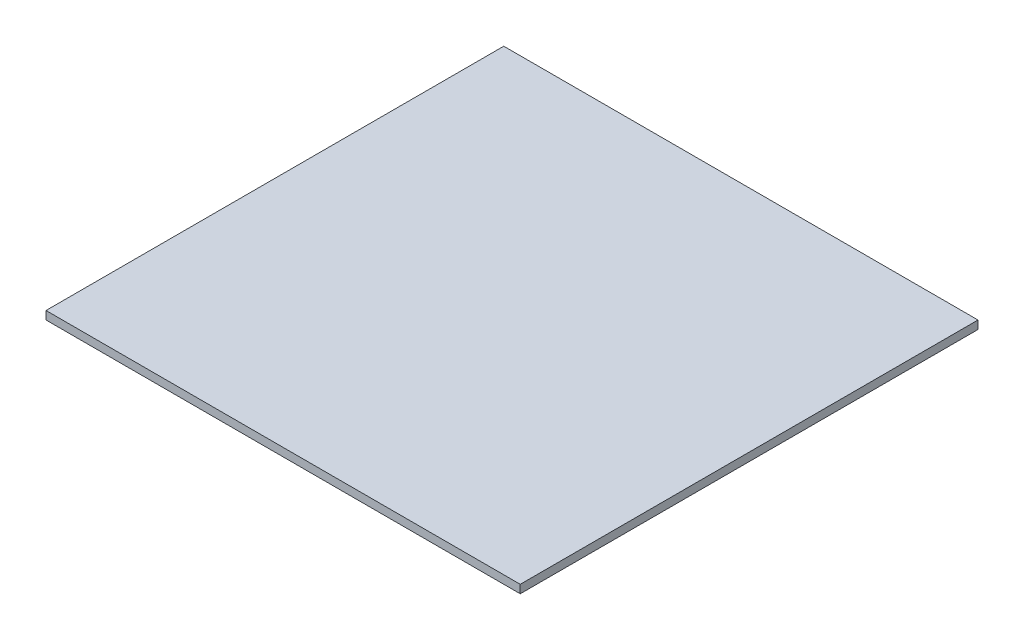
ISO-10303-21;
HEADER;
FILE_DESCRIPTION(('STEP AP214'),'2;1');
FILE_NAME('part.step','',(''),(''),'','','');
FILE_SCHEMA(('AUTOMOTIVE_DESIGN { 1 0 10303 214 1 1 1 1 }'));
ENDSEC;
DATA;
#1=APPLICATION_CONTEXT('core data for automotive mechanical design processes');
#2=APPLICATION_PROTOCOL_DEFINITION('international standard','automotive_design',2000,#1);
#3=PRODUCT_CONTEXT('',#1,'mechanical');
#4=PRODUCT('Part','Part','',(#3));
#5=PRODUCT_RELATED_PRODUCT_CATEGORY('part','',(#4));
#6=PRODUCT_DEFINITION_FORMATION('','',#4);
#7=PRODUCT_DEFINITION_CONTEXT('part definition',#1,'design');
#8=PRODUCT_DEFINITION('design','',#6,#7);
#9=PRODUCT_DEFINITION_SHAPE('','',#8);
#10=(LENGTH_UNIT() NAMED_UNIT(*) SI_UNIT(.MILLI.,.METRE.));
#11=(NAMED_UNIT(*) PLANE_ANGLE_UNIT() SI_UNIT($,.RADIAN.));
#12=(NAMED_UNIT(*) SI_UNIT($,.STERADIAN.) SOLID_ANGLE_UNIT());
#13=UNCERTAINTY_MEASURE_WITH_UNIT(LENGTH_MEASURE(1.E-05),#10,'distance_accuracy_value','');
#14=(GEOMETRIC_REPRESENTATION_CONTEXT(3) GLOBAL_UNCERTAINTY_ASSIGNED_CONTEXT((#13)) GLOBAL_UNIT_ASSIGNED_CONTEXT((#10,
#11,#12)) REPRESENTATION_CONTEXT('',''));
#15=CARTESIAN_POINT('',(0.,0.,0.));
#16=DIRECTION('',(0.,0.,1.));
#17=DIRECTION('',(1.,0.,0.));
#18=AXIS2_PLACEMENT_3D('',#15,#16,#17);
#19=CARTESIAN_POINT('',(0.,1.8,0.));
#20=DIRECTION('',(1.,0.,0.));
#21=DIRECTION('',(0.,0.,-1.));
#22=AXIS2_PLACEMENT_3D('',#19,#20,#21);
#23=PLANE('',#22);
#24=DIRECTION('',(0.,0.,1.));
#25=VECTOR('',#24,1.);
#26=CARTESIAN_POINT('',(0.,0.,0.));
#27=LINE('',#26,#25);
#28=CARTESIAN_POINT('',(0.,0.,-100.));
#29=VERTEX_POINT('',#28);
#30=CARTESIAN_POINT('',(0.,0.,0.));
#31=VERTEX_POINT('',#30);
#32=EDGE_CURVE('E98',#29,#31,#27,.T.);
#33=ORIENTED_EDGE('',*,*,#32,.T.);
#34=DIRECTION('',(0.,-1.,0.));
#35=VECTOR('',#34,1.);
#36=CARTESIAN_POINT('',(0.,1.8,0.));
#37=LINE('',#36,#35);
#38=CARTESIAN_POINT('',(0.,1.8,0.));
#39=VERTEX_POINT('',#38);
#40=EDGE_CURVE('E11',#39,#31,#37,.T.);
#41=ORIENTED_EDGE('',*,*,#40,.F.);
#42=DIRECTION('',(0.,0.,1.));
#43=VECTOR('',#42,1.);
#44=CARTESIAN_POINT('',(0.,1.8,0.));
#45=LINE('',#44,#43);
#46=CARTESIAN_POINT('',(0.,1.8,-100.));
#47=VERTEX_POINT('',#46);
#48=EDGE_CURVE('E86',#47,#39,#45,.T.);
#49=ORIENTED_EDGE('',*,*,#48,.F.);
#50=DIRECTION('',(0.,-1.,0.));
#51=VECTOR('',#50,1.);
#52=CARTESIAN_POINT('',(0.,1.8,-100.));
#53=LINE('',#52,#51);
#54=EDGE_CURVE('E94',#47,#29,#53,.T.);
#55=ORIENTED_EDGE('',*,*,#54,.T.);
#56=EDGE_LOOP('',(#33,#41,#49,#55));
#57=FACE_BOUND('',#56,.T.);
#58=ADVANCED_FACE('F35',(#57),#23,.F.);
#59=CARTESIAN_POINT('',(0.,1.8,0.));
#60=DIRECTION('',(0.,0.,-1.));
#61=DIRECTION('',(-1.,0.,0.));
#62=AXIS2_PLACEMENT_3D('',#59,#60,#61);
#63=PLANE('',#62);
#64=DIRECTION('',(1.,0.,0.));
#65=VECTOR('',#64,1.);
#66=CARTESIAN_POINT('',(0.,0.,0.));
#67=LINE('',#66,#65);
#68=CARTESIAN_POINT('',(103.6,0.,0.));
#69=VERTEX_POINT('',#68);
#70=EDGE_CURVE('E90',#31,#69,#67,.T.);
#71=ORIENTED_EDGE('',*,*,#70,.T.);
#72=DIRECTION('',(0.,-1.,0.));
#73=VECTOR('',#72,1.);
#74=CARTESIAN_POINT('',(103.6,1.8,0.));
#75=LINE('',#74,#73);
#76=CARTESIAN_POINT('',(103.6,1.8,0.));
#77=VERTEX_POINT('',#76);
#78=EDGE_CURVE('E43',#77,#69,#75,.T.);
#79=ORIENTED_EDGE('',*,*,#78,.F.);
#80=DIRECTION('',(1.,0.,0.));
#81=VECTOR('',#80,1.);
#82=CARTESIAN_POINT('',(0.,1.8,0.));
#83=LINE('',#82,#81);
#84=EDGE_CURVE('E81',#39,#77,#83,.T.);
#85=ORIENTED_EDGE('',*,*,#84,.F.);
#86=ORIENTED_EDGE('',*,*,#40,.T.);
#87=EDGE_LOOP('',(#71,#79,#85,#86));
#88=FACE_BOUND('',#87,.T.);
#89=ADVANCED_FACE('F89',(#88),#63,.F.);
#90=CARTESIAN_POINT('',(103.6,1.8,0.));
#91=DIRECTION('',(-1.,0.,0.));
#92=DIRECTION('',(0.,0.,1.));
#93=AXIS2_PLACEMENT_3D('',#90,#91,#92);
#94=PLANE('',#93);
#95=DIRECTION('',(0.,0.,-1.));
#96=VECTOR('',#95,1.);
#97=CARTESIAN_POINT('',(103.6,0.,0.));
#98=LINE('',#97,#96);
#99=CARTESIAN_POINT('',(103.6,0.,-100.));
#100=VERTEX_POINT('',#99);
#101=EDGE_CURVE('E68',#69,#100,#98,.T.);
#102=ORIENTED_EDGE('',*,*,#101,.T.);
#103=DIRECTION('',(0.,-1.,0.));
#104=VECTOR('',#103,1.);
#105=CARTESIAN_POINT('',(103.6,1.8,-100.));
#106=LINE('',#105,#104);
#107=CARTESIAN_POINT('',(103.6,1.8,-100.));
#108=VERTEX_POINT('',#107);
#109=EDGE_CURVE('E91',#108,#100,#106,.T.);
#110=ORIENTED_EDGE('',*,*,#109,.F.);
#111=DIRECTION('',(0.,0.,-1.));
#112=VECTOR('',#111,1.);
#113=CARTESIAN_POINT('',(103.6,1.8,0.));
#114=LINE('',#113,#112);
#115=EDGE_CURVE('E84',#77,#108,#114,.T.);
#116=ORIENTED_EDGE('',*,*,#115,.F.);
#117=ORIENTED_EDGE('',*,*,#78,.T.);
#118=EDGE_LOOP('',(#102,#110,#116,#117));
#119=FACE_BOUND('',#118,.T.);
#120=ADVANCED_FACE('F92',(#119),#94,.F.);
#121=CARTESIAN_POINT('',(0.,1.8,-100.));
#122=DIRECTION('',(0.,0.,1.));
#123=DIRECTION('',(1.,0.,0.));
#124=AXIS2_PLACEMENT_3D('',#121,#122,#123);
#125=PLANE('',#124);
#126=DIRECTION('',(-1.,0.,0.));
#127=VECTOR('',#126,1.);
#128=CARTESIAN_POINT('',(0.,0.,-100.));
#129=LINE('',#128,#127);
#130=EDGE_CURVE('E74',#100,#29,#129,.T.);
#131=ORIENTED_EDGE('',*,*,#130,.T.);
#132=ORIENTED_EDGE('',*,*,#54,.F.);
#133=DIRECTION('',(-1.,0.,0.));
#134=VECTOR('',#133,1.);
#135=CARTESIAN_POINT('',(0.,1.8,-100.));
#136=LINE('',#135,#134);
#137=EDGE_CURVE('E51',#108,#47,#136,.T.);
#138=ORIENTED_EDGE('',*,*,#137,.F.);
#139=ORIENTED_EDGE('',*,*,#109,.T.);
#140=EDGE_LOOP('',(#131,#132,#138,#139));
#141=FACE_BOUND('',#140,.T.);
#142=ADVANCED_FACE('F105',(#141),#125,.F.);
#143=CARTESIAN_POINT('',(0.,1.8,0.));
#144=DIRECTION('',(0.,-1.,0.));
#145=DIRECTION('',(0.,0.,-1.));
#146=AXIS2_PLACEMENT_3D('',#143,#144,#145);
#147=PLANE('',#146);
#148=ORIENTED_EDGE('',*,*,#48,.T.);
#149=ORIENTED_EDGE('',*,*,#84,.T.);
#150=ORIENTED_EDGE('',*,*,#115,.T.);
#151=ORIENTED_EDGE('',*,*,#137,.T.);
#152=EDGE_LOOP('',(#148,#149,#150,#151));
#153=FACE_BOUND('',#152,.T.);
#154=ADVANCED_FACE('F82',(#153),#147,.F.);
#155=CARTESIAN_POINT('',(0.,0.,0.));
#156=DIRECTION('',(0.,-1.,0.));
#157=DIRECTION('',(0.,0.,-1.));
#158=AXIS2_PLACEMENT_3D('',#155,#156,#157);
#159=PLANE('',#158);
#160=ORIENTED_EDGE('',*,*,#32,.F.);
#161=ORIENTED_EDGE('',*,*,#130,.F.);
#162=ORIENTED_EDGE('',*,*,#101,.F.);
#163=ORIENTED_EDGE('',*,*,#70,.F.);
#164=EDGE_LOOP('',(#160,#161,#162,#163));
#165=FACE_BOUND('',#164,.T.);
#166=ADVANCED_FACE('F108',(#165),#159,.T.);
#167=CLOSED_SHELL('',(#58,#89,#120,#142,#154,#166));
#168=MANIFOLD_SOLID_BREP('B2',#167);
#169=ADVANCED_BREP_SHAPE_REPRESENTATION('',(#18,#168),#14);
#170=SHAPE_DEFINITION_REPRESENTATION(#9,#169);
ENDSEC;
END-ISO-10303-21;
